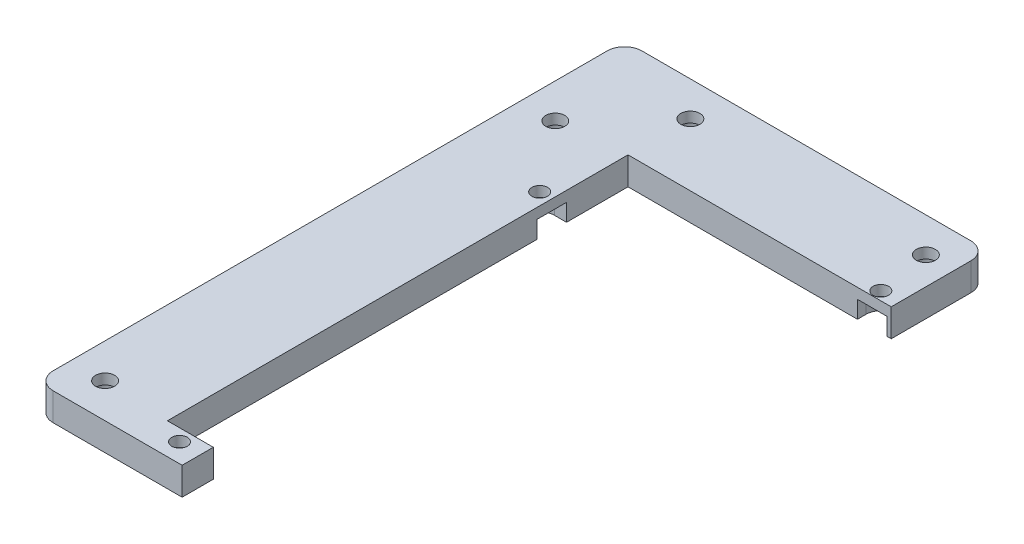
ISO-10303-21;
HEADER;
FILE_DESCRIPTION(('STEP AP214'),'2;1');
FILE_NAME('part.step','',(''),(''),'','','');
FILE_SCHEMA(('AUTOMOTIVE_DESIGN { 1 0 10303 214 1 1 1 1 }'));
ENDSEC;
DATA;
#1=APPLICATION_CONTEXT('core data for automotive mechanical design processes');
#2=APPLICATION_PROTOCOL_DEFINITION('international standard','automotive_design',2000,#1);
#3=PRODUCT_CONTEXT('',#1,'mechanical');
#4=PRODUCT('Part','Part','',(#3));
#5=PRODUCT_RELATED_PRODUCT_CATEGORY('part','',(#4));
#6=PRODUCT_DEFINITION_FORMATION('','',#4);
#7=PRODUCT_DEFINITION_CONTEXT('part definition',#1,'design');
#8=PRODUCT_DEFINITION('design','',#6,#7);
#9=PRODUCT_DEFINITION_SHAPE('','',#8);
#10=(LENGTH_UNIT() NAMED_UNIT(*) SI_UNIT(.MILLI.,.METRE.));
#11=(NAMED_UNIT(*) PLANE_ANGLE_UNIT() SI_UNIT($,.RADIAN.));
#12=(NAMED_UNIT(*) SI_UNIT($,.STERADIAN.) SOLID_ANGLE_UNIT());
#13=UNCERTAINTY_MEASURE_WITH_UNIT(LENGTH_MEASURE(1.E-05),#10,'distance_accuracy_value','');
#14=(GEOMETRIC_REPRESENTATION_CONTEXT(3) GLOBAL_UNCERTAINTY_ASSIGNED_CONTEXT((#13)) GLOBAL_UNIT_ASSIGNED_CONTEXT((#10,
#11,#12)) REPRESENTATION_CONTEXT('',''));
#15=CARTESIAN_POINT('',(0.,0.,0.));
#16=DIRECTION('',(0.,0.,1.));
#17=DIRECTION('',(1.,0.,0.));
#18=AXIS2_PLACEMENT_3D('',#15,#16,#17);
#19=CARTESIAN_POINT('',(-23.5,-4.,0.));
#20=DIRECTION('',(-1.,0.,0.));
#21=DIRECTION('',(0.,0.,1.));
#22=AXIS2_PLACEMENT_3D('',#19,#20,#21);
#23=PLANE('',#22);
#24=DIRECTION('',(0.,-1.,0.));
#25=VECTOR('',#24,1.);
#26=CARTESIAN_POINT('',(-23.5,1.,-30.75));
#27=LINE('',#26,#25);
#28=CARTESIAN_POINT('',(-23.5,1.,-30.75));
#29=VERTEX_POINT('',#28);
#30=CARTESIAN_POINT('',(-23.5,-4.,-30.75));
#31=VERTEX_POINT('',#30);
#32=EDGE_CURVE('E490',#29,#31,#27,.T.);
#33=ORIENTED_EDGE('',*,*,#32,.F.);
#34=DIRECTION('',(0.,0.,1.));
#35=VECTOR('',#34,1.);
#36=CARTESIAN_POINT('',(-23.5,1.,-39.25));
#37=LINE('',#36,#35);
#38=CARTESIAN_POINT('',(-23.5,1.,-39.25));
#39=VERTEX_POINT('',#38);
#40=EDGE_CURVE('E509',#39,#29,#37,.T.);
#41=ORIENTED_EDGE('',*,*,#40,.F.);
#42=DIRECTION('',(0.,-1.,0.));
#43=VECTOR('',#42,1.);
#44=CARTESIAN_POINT('',(-23.5,1.,-39.25));
#45=LINE('',#44,#43);
#46=CARTESIAN_POINT('',(-23.5,-4.,-39.25));
#47=VERTEX_POINT('',#46);
#48=EDGE_CURVE('E486',#39,#47,#45,.T.);
#49=ORIENTED_EDGE('',*,*,#48,.T.);
#50=DIRECTION('',(0.,0.,1.));
#51=VECTOR('',#50,1.);
#52=CARTESIAN_POINT('',(-23.5,-4.,0.));
#53=LINE('',#52,#51);
#54=CARTESIAN_POINT('',(-23.5,-4.,-57.));
#55=VERTEX_POINT('',#54);
#56=EDGE_CURVE('E238',#55,#47,#53,.T.);
#57=ORIENTED_EDGE('',*,*,#56,.F.);
#58=DIRECTION('',(0.,1.,0.));
#59=VECTOR('',#58,1.);
#60=CARTESIAN_POINT('',(-23.5,-4.,-57.));
#61=LINE('',#60,#59);
#62=CARTESIAN_POINT('',(-23.5,4.,-57.));
#63=VERTEX_POINT('',#62);
#64=EDGE_CURVE('E227',#55,#63,#61,.T.);
#65=ORIENTED_EDGE('',*,*,#64,.T.);
#66=DIRECTION('',(0.,0.,1.));
#67=VECTOR('',#66,1.);
#68=CARTESIAN_POINT('',(-23.5,4.,0.));
#69=LINE('',#68,#67);
#70=CARTESIAN_POINT('',(-23.5,4.,76.));
#71=VERTEX_POINT('',#70);
#72=EDGE_CURVE('E362',#63,#71,#69,.T.);
#73=ORIENTED_EDGE('',*,*,#72,.T.);
#74=DIRECTION('',(0.,1.,0.));
#75=VECTOR('',#74,1.);
#76=CARTESIAN_POINT('',(-23.5,-4.,76.));
#77=LINE('',#76,#75);
#78=CARTESIAN_POINT('',(-23.5,-4.,76.));
#79=VERTEX_POINT('',#78);
#80=EDGE_CURVE('E258',#79,#71,#77,.T.);
#81=ORIENTED_EDGE('',*,*,#80,.F.);
#82=EDGE_CURVE('E402',#31,#79,#53,.T.);
#83=ORIENTED_EDGE('',*,*,#82,.F.);
#84=EDGE_LOOP('',(#33,#41,#49,#57,#65,#73,#81,#83));
#85=FACE_BOUND('',#84,.T.);
#86=ADVANCED_FACE('F43',(#85),#23,.F.);
#87=CARTESIAN_POINT('',(0.,-4.,76.));
#88=DIRECTION('',(0.,0.,1.));
#89=DIRECTION('',(1.,0.,0.));
#90=AXIS2_PLACEMENT_3D('',#87,#88,#89);
#91=PLANE('',#90);
#92=DIRECTION('',(0.,-1.,0.));
#93=VECTOR('',#92,1.);
#94=CARTESIAN_POINT('',(-12.25,1.,76.));
#95=LINE('',#94,#93);
#96=CARTESIAN_POINT('',(-12.25,1.,76.));
#97=VERTEX_POINT('',#96);
#98=CARTESIAN_POINT('',(-12.25,-4.,76.));
#99=VERTEX_POINT('',#98);
#100=EDGE_CURVE('E527',#97,#99,#95,.T.);
#101=ORIENTED_EDGE('',*,*,#100,.F.);
#102=DIRECTION('',(-1.,0.,0.));
#103=VECTOR('',#102,1.);
#104=CARTESIAN_POINT('',(-12.25,1.,76.));
#105=LINE('',#104,#103);
#106=CARTESIAN_POINT('',(-20.75,1.,76.));
#107=VERTEX_POINT('',#106);
#108=EDGE_CURVE('E558',#97,#107,#105,.T.);
#109=ORIENTED_EDGE('',*,*,#108,.T.);
#110=DIRECTION('',(0.,-1.,0.));
#111=VECTOR('',#110,1.);
#112=CARTESIAN_POINT('',(-20.75,1.,76.));
#113=LINE('',#112,#111);
#114=CARTESIAN_POINT('',(-20.75,-4.,76.));
#115=VERTEX_POINT('',#114);
#116=EDGE_CURVE('E530',#107,#115,#113,.T.);
#117=ORIENTED_EDGE('',*,*,#116,.T.);
#118=DIRECTION('',(1.,0.,0.));
#119=VECTOR('',#118,1.);
#120=CARTESIAN_POINT('',(0.,-4.,76.));
#121=LINE('',#120,#119);
#122=EDGE_CURVE('E399',#79,#115,#121,.T.);
#123=ORIENTED_EDGE('',*,*,#122,.F.);
#124=ORIENTED_EDGE('',*,*,#80,.T.);
#125=DIRECTION('',(1.,0.,0.));
#126=VECTOR('',#125,1.);
#127=CARTESIAN_POINT('',(0.,4.,76.));
#128=LINE('',#127,#126);
#129=CARTESIAN_POINT('',(-10.25,4.,76.));
#130=VERTEX_POINT('',#129);
#131=EDGE_CURVE('E358',#71,#130,#128,.T.);
#132=ORIENTED_EDGE('',*,*,#131,.T.);
#133=DIRECTION('',(0.,1.,0.));
#134=VECTOR('',#133,1.);
#135=CARTESIAN_POINT('',(-10.25,-4.,76.));
#136=LINE('',#135,#134);
#137=CARTESIAN_POINT('',(-10.25,-4.,76.));
#138=VERTEX_POINT('',#137);
#139=EDGE_CURVE('E261',#138,#130,#136,.T.);
#140=ORIENTED_EDGE('',*,*,#139,.F.);
#141=EDGE_CURVE('E398',#99,#138,#121,.T.);
#142=ORIENTED_EDGE('',*,*,#141,.F.);
#143=EDGE_LOOP('',(#101,#109,#117,#123,#124,#132,#140,#142));
#144=FACE_BOUND('',#143,.T.);
#145=ADVANCED_FACE('F415',(#144),#91,.F.);
#146=CARTESIAN_POINT('',(-42.5,-4.,75.));
#147=DIRECTION('',(0.,1.,0.));
#148=DIRECTION('',(0.,0.,1.));
#149=AXIS2_PLACEMENT_3D('',#146,#147,#148);
#150=CYLINDRICAL_SURFACE('',#149,2.75);
#151=CARTESIAN_POINT('',(-42.5,4.,75.));
#152=DIRECTION('',(0.,1.,0.));
#153=DIRECTION('',(0.,0.,1.));
#154=AXIS2_PLACEMENT_3D('',#151,#152,#153);
#155=CIRCLE('',#154,2.75);
#156=CARTESIAN_POINT('',(-42.5,4.,77.75));
#157=VERTEX_POINT('',#156);
#158=EDGE_CURVE('E334',#157,#157,#155,.T.);
#159=ORIENTED_EDGE('',*,*,#158,.T.);
#160=EDGE_LOOP('',(#159));
#161=FACE_BOUND('',#160,.T.);
#162=CARTESIAN_POINT('',(-42.5,1.,75.));
#163=DIRECTION('',(0.,-1.,0.));
#164=DIRECTION('',(0.,0.,-1.));
#165=AXIS2_PLACEMENT_3D('',#162,#163,#164);
#166=CIRCLE('',#165,2.75);
#167=CARTESIAN_POINT('',(-42.5,1.,72.25));
#168=VERTEX_POINT('',#167);
#169=EDGE_CURVE('E47',#168,#168,#166,.F.);
#170=ORIENTED_EDGE('',*,*,#169,.F.);
#171=EDGE_LOOP('',(#170));
#172=FACE_BOUND('',#171,.T.);
#173=ADVANCED_FACE('F612',(#161,#172),#150,.F.);
#174=CARTESIAN_POINT('',(-16.5,-4.,79.5));
#175=DIRECTION('',(0.,1.,0.));
#176=DIRECTION('',(0.,0.,1.));
#177=AXIS2_PLACEMENT_3D('',#174,#175,#176);
#178=CYLINDRICAL_SURFACE('',#177,2.25);
#179=CARTESIAN_POINT('',(-16.5,4.,79.5));
#180=DIRECTION('',(0.,1.,0.));
#181=DIRECTION('',(0.,0.,1.));
#182=AXIS2_PLACEMENT_3D('',#179,#180,#181);
#183=CIRCLE('',#182,2.25);
#184=CARTESIAN_POINT('',(-16.5,4.,81.75));
#185=VERTEX_POINT('',#184);
#186=EDGE_CURVE('E330',#185,#185,#183,.T.);
#187=ORIENTED_EDGE('',*,*,#186,.T.);
#188=EDGE_LOOP('',(#187));
#189=FACE_BOUND('',#188,.T.);
#190=CARTESIAN_POINT('',(-16.5,1.,79.5));
#191=DIRECTION('',(0.,-1.,0.));
#192=DIRECTION('',(0.,0.,-1.));
#193=AXIS2_PLACEMENT_3D('',#190,#191,#192);
#194=CIRCLE('',#193,2.25);
#195=CARTESIAN_POINT('',(-16.5,1.,77.25));
#196=VERTEX_POINT('',#195);
#197=EDGE_CURVE('E295',#196,#196,#194,.F.);
#198=ORIENTED_EDGE('',*,*,#197,.F.);
#199=EDGE_LOOP('',(#198));
#200=FACE_BOUND('',#199,.T.);
#201=ADVANCED_FACE('F631',(#189,#200),#178,.F.);
#202=CARTESIAN_POINT('',(-27.,-4.,-35.));
#203=DIRECTION('',(0.,1.,0.));
#204=DIRECTION('',(0.,0.,1.));
#205=AXIS2_PLACEMENT_3D('',#202,#203,#204);
#206=CYLINDRICAL_SURFACE('',#205,2.25);
#207=CARTESIAN_POINT('',(-27.,4.,-35.));
#208=DIRECTION('',(0.,1.,0.));
#209=DIRECTION('',(0.,0.,1.));
#210=AXIS2_PLACEMENT_3D('',#207,#208,#209);
#211=CIRCLE('',#210,2.25);
#212=CARTESIAN_POINT('',(-27.,4.,-32.75));
#213=VERTEX_POINT('',#212);
#214=EDGE_CURVE('E326',#213,#213,#211,.T.);
#215=ORIENTED_EDGE('',*,*,#214,.T.);
#216=EDGE_LOOP('',(#215));
#217=FACE_BOUND('',#216,.T.);
#218=CARTESIAN_POINT('',(-27.,1.,-35.));
#219=DIRECTION('',(0.,-1.,0.));
#220=DIRECTION('',(0.,0.,-1.));
#221=AXIS2_PLACEMENT_3D('',#218,#219,#220);
#222=CIRCLE('',#221,2.25);
#223=CARTESIAN_POINT('',(-27.,1.,-37.25));
#224=VERTEX_POINT('',#223);
#225=EDGE_CURVE('E292',#224,#224,#222,.F.);
#226=ORIENTED_EDGE('',*,*,#225,.F.);
#227=EDGE_LOOP('',(#226));
#228=FACE_BOUND('',#227,.T.);
#229=ADVANCED_FACE('F635',(#217,#228),#206,.F.);
#230=CARTESIAN_POINT('',(47.,-4.,-59.5));
#231=DIRECTION('',(0.,1.,0.));
#232=DIRECTION('',(0.,0.,1.));
#233=AXIS2_PLACEMENT_3D('',#230,#231,#232);
#234=CYLINDRICAL_SURFACE('',#233,2.25);
#235=CARTESIAN_POINT('',(47.,4.,-59.5));
#236=DIRECTION('',(0.,1.,0.));
#237=DIRECTION('',(0.,0.,1.));
#238=AXIS2_PLACEMENT_3D('',#235,#236,#237);
#239=CIRCLE('',#238,2.25);
#240=CARTESIAN_POINT('',(47.,4.,-57.25));
#241=VERTEX_POINT('',#240);
#242=EDGE_CURVE('E322',#241,#241,#239,.T.);
#243=ORIENTED_EDGE('',*,*,#242,.T.);
#244=EDGE_LOOP('',(#243));
#245=FACE_BOUND('',#244,.T.);
#246=CARTESIAN_POINT('',(47.,1.,-59.5));
#247=DIRECTION('',(0.,-1.,0.));
#248=DIRECTION('',(0.,0.,-1.));
#249=AXIS2_PLACEMENT_3D('',#246,#247,#248);
#250=CIRCLE('',#249,2.25);
#251=CARTESIAN_POINT('',(47.,1.,-61.75));
#252=VERTEX_POINT('',#251);
#253=EDGE_CURVE('E288',#252,#252,#250,.F.);
#254=ORIENTED_EDGE('',*,*,#253,.F.);
#255=EDGE_LOOP('',(#254));
#256=FACE_BOUND('',#255,.T.);
#257=ADVANCED_FACE('F639',(#245,#256),#234,.F.);
#258=CARTESIAN_POINT('',(-23.5,-4.,-75.));
#259=DIRECTION('',(0.,1.,0.));
#260=DIRECTION('',(0.,0.,1.));
#261=AXIS2_PLACEMENT_3D('',#258,#259,#260);
#262=CYLINDRICAL_SURFACE('',#261,2.75);
#263=CARTESIAN_POINT('',(-23.5,4.,-75.));
#264=DIRECTION('',(0.,1.,0.));
#265=DIRECTION('',(0.,0.,1.));
#266=AXIS2_PLACEMENT_3D('',#263,#264,#265);
#267=CIRCLE('',#266,2.75);
#268=CARTESIAN_POINT('',(-23.5,4.,-72.25));
#269=VERTEX_POINT('',#268);
#270=EDGE_CURVE('E313',#269,#269,#267,.T.);
#271=ORIENTED_EDGE('',*,*,#270,.T.);
#272=EDGE_LOOP('',(#271));
#273=FACE_BOUND('',#272,.T.);
#274=CARTESIAN_POINT('',(-23.5,1.,-75.));
#275=DIRECTION('',(0.,-1.,0.));
#276=DIRECTION('',(0.,0.,-1.));
#277=AXIS2_PLACEMENT_3D('',#274,#275,#276);
#278=CIRCLE('',#277,2.75);
#279=CARTESIAN_POINT('',(-23.5,1.,-77.75));
#280=VERTEX_POINT('',#279);
#281=EDGE_CURVE('E284',#280,#280,#278,.F.);
#282=ORIENTED_EDGE('',*,*,#281,.F.);
#283=EDGE_LOOP('',(#282));
#284=FACE_BOUND('',#283,.T.);
#285=ADVANCED_FACE('F643',(#273,#284),#262,.F.);
#286=CARTESIAN_POINT('',(-42.5,-4.,-55.));
#287=DIRECTION('',(0.,1.,0.));
#288=DIRECTION('',(0.,0.,1.));
#289=AXIS2_PLACEMENT_3D('',#286,#287,#288);
#290=CYLINDRICAL_SURFACE('',#289,2.74999999999998);
#291=CARTESIAN_POINT('',(-42.5,4.,-55.));
#292=DIRECTION('',(0.,1.,0.));
#293=DIRECTION('',(0.,0.,1.));
#294=AXIS2_PLACEMENT_3D('',#291,#292,#293);
#295=CIRCLE('',#294,2.74999999999998);
#296=CARTESIAN_POINT('',(-42.5,4.,-52.25));
#297=VERTEX_POINT('',#296);
#298=EDGE_CURVE('E307',#297,#297,#295,.T.);
#299=ORIENTED_EDGE('',*,*,#298,.T.);
#300=EDGE_LOOP('',(#299));
#301=FACE_BOUND('',#300,.T.);
#302=CARTESIAN_POINT('',(-42.5,1.,-55.));
#303=DIRECTION('',(0.,-1.,0.));
#304=DIRECTION('',(0.,0.,-1.));
#305=AXIS2_PLACEMENT_3D('',#302,#303,#304);
#306=CIRCLE('',#305,2.74999999999998);
#307=CARTESIAN_POINT('',(-42.5,1.,-57.75));
#308=VERTEX_POINT('',#307);
#309=EDGE_CURVE('E279',#308,#308,#306,.F.);
#310=ORIENTED_EDGE('',*,*,#309,.F.);
#311=EDGE_LOOP('',(#310));
#312=FACE_BOUND('',#311,.T.);
#313=ADVANCED_FACE('F646',(#301,#312),#290,.F.);
#314=CARTESIAN_POINT('',(44.5,-4.,-75.));
#315=DIRECTION('',(0.,1.,0.));
#316=DIRECTION('',(0.,0.,1.));
#317=AXIS2_PLACEMENT_3D('',#314,#315,#316);
#318=CYLINDRICAL_SURFACE('',#317,2.75);
#319=CARTESIAN_POINT('',(44.5,4.,-75.));
#320=DIRECTION('',(0.,1.,0.));
#321=DIRECTION('',(0.,0.,1.));
#322=AXIS2_PLACEMENT_3D('',#319,#320,#321);
#323=CIRCLE('',#322,2.75);
#324=CARTESIAN_POINT('',(44.5,4.,-72.25));
#325=VERTEX_POINT('',#324);
#326=EDGE_CURVE('E302',#325,#325,#323,.T.);
#327=ORIENTED_EDGE('',*,*,#326,.T.);
#328=EDGE_LOOP('',(#327));
#329=FACE_BOUND('',#328,.T.);
#330=CARTESIAN_POINT('',(44.5,1.,-75.));
#331=DIRECTION('',(0.,-1.,0.));
#332=DIRECTION('',(0.,0.,-1.));
#333=AXIS2_PLACEMENT_3D('',#330,#331,#332);
#334=CIRCLE('',#333,2.75);
#335=CARTESIAN_POINT('',(44.5,1.,-77.75));
#336=VERTEX_POINT('',#335);
#337=EDGE_CURVE('E275',#336,#336,#334,.F.);
#338=ORIENTED_EDGE('',*,*,#337,.F.);
#339=EDGE_LOOP('',(#338));
#340=FACE_BOUND('',#339,.T.);
#341=ADVANCED_FACE('F45',(#329,#340),#318,.F.);
#342=CARTESIAN_POINT('',(0.,-4.,0.));
#343=DIRECTION('',(0.,1.,0.));
#344=DIRECTION('',(0.,0.,1.));
#345=AXIS2_PLACEMENT_3D('',#342,#343,#344);
#346=PLANE('',#345);
#347=CARTESIAN_POINT('',(-42.5,-4.,75.));
#348=DIRECTION('',(0.,-1.,0.));
#349=DIRECTION('',(0.,0.,-1.));
#350=AXIS2_PLACEMENT_3D('',#347,#348,#349);
#351=CIRCLE('',#350,4.25);
#352=CARTESIAN_POINT('',(-42.5,-4.,70.75));
#353=VERTEX_POINT('',#352);
#354=EDGE_CURVE('E531',#353,#353,#351,.T.);
#355=ORIENTED_EDGE('',*,*,#354,.F.);
#356=EDGE_LOOP('',(#355));
#357=FACE_BOUND('',#356,.T.);
#358=CARTESIAN_POINT('',(44.5,-4.,-75.));
#359=DIRECTION('',(0.,-1.,0.));
#360=DIRECTION('',(0.,0.,-1.));
#361=AXIS2_PLACEMENT_3D('',#358,#359,#360);
#362=CIRCLE('',#361,4.25);
#363=CARTESIAN_POINT('',(44.5,-4.,-79.25));
#364=VERTEX_POINT('',#363);
#365=EDGE_CURVE('E577',#364,#364,#362,.T.);
#366=ORIENTED_EDGE('',*,*,#365,.F.);
#367=EDGE_LOOP('',(#366));
#368=FACE_BOUND('',#367,.T.);
#369=CARTESIAN_POINT('',(-23.5,-4.,-75.));
#370=DIRECTION('',(0.,-1.,0.));
#371=DIRECTION('',(0.,0.,-1.));
#372=AXIS2_PLACEMENT_3D('',#369,#370,#371);
#373=CIRCLE('',#372,4.25);
#374=CARTESIAN_POINT('',(-23.5,-4.,-79.25));
#375=VERTEX_POINT('',#374);
#376=EDGE_CURVE('E316',#375,#375,#373,.T.);
#377=ORIENTED_EDGE('',*,*,#376,.F.);
#378=EDGE_LOOP('',(#377));
#379=FACE_BOUND('',#378,.T.);
#380=CARTESIAN_POINT('',(-42.5,-4.,-55.));
#381=DIRECTION('',(0.,-1.,0.));
#382=DIRECTION('',(0.,0.,-1.));
#383=AXIS2_PLACEMENT_3D('',#380,#381,#382);
#384=CIRCLE('',#383,4.25);
#385=CARTESIAN_POINT('',(-42.5,-4.,-59.25));
#386=VERTEX_POINT('',#385);
#387=EDGE_CURVE('E496',#386,#386,#384,.T.);
#388=ORIENTED_EDGE('',*,*,#387,.F.);
#389=EDGE_LOOP('',(#388));
#390=FACE_BOUND('',#389,.T.);
#391=DIRECTION('',(0.,0.,-1.));
#392=VECTOR('',#391,1.);
#393=CARTESIAN_POINT('',(-12.25,-4.,79.5));
#394=LINE('',#393,#392);
#395=CARTESIAN_POINT('',(-12.25,-4.,79.5));
#396=VERTEX_POINT('',#395);
#397=EDGE_CURVE('E61',#396,#99,#394,.T.);
#398=ORIENTED_EDGE('',*,*,#397,.T.);
#399=ORIENTED_EDGE('',*,*,#141,.T.);
#400=DIRECTION('',(0.,0.,1.));
#401=VECTOR('',#400,1.);
#402=CARTESIAN_POINT('',(-10.25,-4.,0.));
#403=LINE('',#402,#401);
#404=CARTESIAN_POINT('',(-10.25,-4.,85.));
#405=VERTEX_POINT('',#404);
#406=EDGE_CURVE('E396',#138,#405,#403,.T.);
#407=ORIENTED_EDGE('',*,*,#406,.T.);
#408=DIRECTION('',(1.,0.,0.));
#409=VECTOR('',#408,1.);
#410=CARTESIAN_POINT('',(0.,-4.,85.));
#411=LINE('',#410,#409);
#412=CARTESIAN_POINT('',(-47.4999999999999,-4.,85.));
#413=VERTEX_POINT('',#412);
#414=EDGE_CURVE('E392',#413,#405,#411,.T.);
#415=ORIENTED_EDGE('',*,*,#414,.F.);
#416=CARTESIAN_POINT('',(-47.5,-4.,80.));
#417=DIRECTION('',(0.,1.,0.));
#418=DIRECTION('',(0.,0.,1.));
#419=AXIS2_PLACEMENT_3D('',#416,#417,#418);
#420=CIRCLE('',#419,5.);
#421=CARTESIAN_POINT('',(-52.5,-4.,80.));
#422=VERTEX_POINT('',#421);
#423=EDGE_CURVE('E389',#413,#422,#420,.F.);
#424=ORIENTED_EDGE('',*,*,#423,.T.);
#425=DIRECTION('',(0.,0.,-1.));
#426=VECTOR('',#425,1.);
#427=CARTESIAN_POINT('',(-52.5,-4.,0.));
#428=LINE('',#427,#426);
#429=CARTESIAN_POINT('',(-52.5,-4.,-80.));
#430=VERTEX_POINT('',#429);
#431=EDGE_CURVE('E386',#422,#430,#428,.T.);
#432=ORIENTED_EDGE('',*,*,#431,.T.);
#433=CARTESIAN_POINT('',(-47.5,-4.,-80.));
#434=DIRECTION('',(0.,1.,0.));
#435=DIRECTION('',(0.,0.,1.));
#436=AXIS2_PLACEMENT_3D('',#433,#434,#435);
#437=CIRCLE('',#436,5.);
#438=CARTESIAN_POINT('',(-47.4999999999999,-4.,-85.));
#439=VERTEX_POINT('',#438);
#440=EDGE_CURVE('E382',#430,#439,#437,.F.);
#441=ORIENTED_EDGE('',*,*,#440,.T.);
#442=DIRECTION('',(1.,0.,0.));
#443=VECTOR('',#442,1.);
#444=CARTESIAN_POINT('',(0.,-4.,-85.));
#445=LINE('',#444,#443);
#446=CARTESIAN_POINT('',(47.5,-4.,-85.));
#447=VERTEX_POINT('',#446);
#448=EDGE_CURVE('E244',#439,#447,#445,.T.);
#449=ORIENTED_EDGE('',*,*,#448,.T.);
#450=CARTESIAN_POINT('',(47.5,-4.,-80.));
#451=DIRECTION('',(0.,1.,0.));
#452=DIRECTION('',(0.,0.,1.));
#453=AXIS2_PLACEMENT_3D('',#450,#451,#452);
#454=CIRCLE('',#453,5.);
#455=CARTESIAN_POINT('',(52.5,-4.,-80.));
#456=VERTEX_POINT('',#455);
#457=EDGE_CURVE('E236',#447,#456,#454,.F.);
#458=ORIENTED_EDGE('',*,*,#457,.T.);
#459=DIRECTION('',(0.,0.,-1.));
#460=VECTOR('',#459,1.);
#461=CARTESIAN_POINT('',(52.5,-4.,0.));
#462=LINE('',#461,#460);
#463=CARTESIAN_POINT('',(52.5,-4.,-57.));
#464=VERTEX_POINT('',#463);
#465=EDGE_CURVE('E230',#464,#456,#462,.T.);
#466=ORIENTED_EDGE('',*,*,#465,.F.);
#467=DIRECTION('',(1.,0.,0.));
#468=VECTOR('',#467,1.);
#469=CARTESIAN_POINT('',(0.,-4.,-57.));
#470=LINE('',#469,#468);
#471=CARTESIAN_POINT('',(51.25,-4.,-57.));
#472=VERTEX_POINT('',#471);
#473=EDGE_CURVE('E231',#472,#464,#470,.T.);
#474=ORIENTED_EDGE('',*,*,#473,.F.);
#475=DIRECTION('',(0.,0.,1.));
#476=VECTOR('',#475,1.);
#477=CARTESIAN_POINT('',(51.25,-4.,-59.5));
#478=LINE('',#477,#476);
#479=CARTESIAN_POINT('',(51.25,-4.,-59.5));
#480=VERTEX_POINT('',#479);
#481=EDGE_CURVE('E453',#480,#472,#478,.T.);
#482=ORIENTED_EDGE('',*,*,#481,.F.);
#483=CARTESIAN_POINT('',(47.,-4.,-59.5));
#484=DIRECTION('',(0.,-1.,0.));
#485=DIRECTION('',(0.,0.,-1.));
#486=AXIS2_PLACEMENT_3D('',#483,#484,#485);
#487=CIRCLE('',#486,4.25);
#488=CARTESIAN_POINT('',(42.75,-4.,-59.5));
#489=VERTEX_POINT('',#488);
#490=EDGE_CURVE('E221',#489,#480,#487,.T.);
#491=ORIENTED_EDGE('',*,*,#490,.F.);
#492=DIRECTION('',(0.,0.,-1.));
#493=VECTOR('',#492,1.);
#494=CARTESIAN_POINT('',(42.75,-4.,-57.));
#495=LINE('',#494,#493);
#496=CARTESIAN_POINT('',(42.75,-4.,-57.));
#497=VERTEX_POINT('',#496);
#498=EDGE_CURVE('E202',#497,#489,#495,.T.);
#499=ORIENTED_EDGE('',*,*,#498,.F.);
#500=EDGE_CURVE('E218',#55,#497,#470,.T.);
#501=ORIENTED_EDGE('',*,*,#500,.F.);
#502=ORIENTED_EDGE('',*,*,#56,.T.);
#503=DIRECTION('',(1.,0.,0.));
#504=VECTOR('',#503,1.);
#505=CARTESIAN_POINT('',(-27.,-4.,-39.25));
#506=LINE('',#505,#504);
#507=CARTESIAN_POINT('',(-27.,-4.,-39.25));
#508=VERTEX_POINT('',#507);
#509=EDGE_CURVE('E501',#508,#47,#506,.T.);
#510=ORIENTED_EDGE('',*,*,#509,.F.);
#511=CARTESIAN_POINT('',(-27.,-4.,-35.));
#512=DIRECTION('',(0.,-1.,0.));
#513=DIRECTION('',(0.,0.,-1.));
#514=AXIS2_PLACEMENT_3D('',#511,#512,#513);
#515=CIRCLE('',#514,4.25);
#516=CARTESIAN_POINT('',(-27.,-4.,-30.75));
#517=VERTEX_POINT('',#516);
#518=EDGE_CURVE('E69',#517,#508,#515,.T.);
#519=ORIENTED_EDGE('',*,*,#518,.F.);
#520=DIRECTION('',(1.,0.,0.));
#521=VECTOR('',#520,1.);
#522=CARTESIAN_POINT('',(-27.,-4.,-30.75));
#523=LINE('',#522,#521);
#524=EDGE_CURVE('E497',#517,#31,#523,.T.);
#525=ORIENTED_EDGE('',*,*,#524,.T.);
#526=ORIENTED_EDGE('',*,*,#82,.T.);
#527=ORIENTED_EDGE('',*,*,#122,.T.);
#528=DIRECTION('',(0.,0.,1.));
#529=VECTOR('',#528,1.);
#530=CARTESIAN_POINT('',(-20.75,-4.,76.));
#531=LINE('',#530,#529);
#532=CARTESIAN_POINT('',(-20.75,-4.,79.5));
#533=VERTEX_POINT('',#532);
#534=EDGE_CURVE('E546',#115,#533,#531,.T.);
#535=ORIENTED_EDGE('',*,*,#534,.T.);
#536=CARTESIAN_POINT('',(-16.5,-4.,79.5));
#537=DIRECTION('',(0.,-1.,0.));
#538=DIRECTION('',(0.,0.,-1.));
#539=AXIS2_PLACEMENT_3D('',#536,#537,#538);
#540=CIRCLE('',#539,4.25);
#541=EDGE_CURVE('E542',#396,#533,#540,.T.);
#542=ORIENTED_EDGE('',*,*,#541,.F.);
#543=EDGE_LOOP('',(#398,#399,#407,#415,#424,#432,#441,#449,#458,#466,#474,#482,#491,#499,#501,
#502,#510,#519,#525,#526,#527,#535,#542));
#544=FACE_BOUND('',#543,.T.);
#545=ADVANCED_FACE('F216',(#357,#368,#379,#390,#544),#346,.F.);
#546=CARTESIAN_POINT('',(-47.5,-4.,-80.));
#547=DIRECTION('',(0.,1.,0.));
#548=DIRECTION('',(0.,0.,1.));
#549=AXIS2_PLACEMENT_3D('',#546,#547,#548);
#550=CYLINDRICAL_SURFACE('',#549,5.);
#551=DIRECTION('',(0.,1.,0.));
#552=VECTOR('',#551,1.);
#553=CARTESIAN_POINT('',(-52.5,-4.,-80.));
#554=LINE('',#553,#552);
#555=CARTESIAN_POINT('',(-52.5,4.,-80.));
#556=VERTEX_POINT('',#555);
#557=EDGE_CURVE('E246',#430,#556,#554,.T.);
#558=ORIENTED_EDGE('',*,*,#557,.T.);
#559=CARTESIAN_POINT('',(-47.5,4.,-80.));
#560=DIRECTION('',(0.,1.,0.));
#561=DIRECTION('',(0.,0.,1.));
#562=AXIS2_PLACEMENT_3D('',#559,#560,#561);
#563=CIRCLE('',#562,5.);
#564=CARTESIAN_POINT('',(-47.4999999999999,4.,-85.));
#565=VERTEX_POINT('',#564);
#566=EDGE_CURVE('E338',#556,#565,#563,.F.);
#567=ORIENTED_EDGE('',*,*,#566,.T.);
#568=DIRECTION('',(0.,1.,0.));
#569=VECTOR('',#568,1.);
#570=CARTESIAN_POINT('',(-47.4999999999999,-4.,-85.));
#571=LINE('',#570,#569);
#572=EDGE_CURVE('E11',#439,#565,#571,.T.);
#573=ORIENTED_EDGE('',*,*,#572,.F.);
#574=ORIENTED_EDGE('',*,*,#440,.F.);
#575=EDGE_LOOP('',(#558,#567,#573,#574));
#576=FACE_BOUND('',#575,.T.);
#577=ADVANCED_FACE('F437',(#576),#550,.T.);
#578=CARTESIAN_POINT('',(0.,-4.,-85.));
#579=DIRECTION('',(0.,0.,1.));
#580=DIRECTION('',(1.,0.,0.));
#581=AXIS2_PLACEMENT_3D('',#578,#579,#580);
#582=PLANE('',#581);
#583=ORIENTED_EDGE('',*,*,#572,.T.);
#584=DIRECTION('',(1.,0.,0.));
#585=VECTOR('',#584,1.);
#586=CARTESIAN_POINT('',(0.,4.,-85.));
#587=LINE('',#586,#585);
#588=CARTESIAN_POINT('',(47.5,4.,-85.));
#589=VERTEX_POINT('',#588);
#590=EDGE_CURVE('E378',#565,#589,#587,.T.);
#591=ORIENTED_EDGE('',*,*,#590,.T.);
#592=DIRECTION('',(0.,1.,0.));
#593=VECTOR('',#592,1.);
#594=CARTESIAN_POINT('',(47.5,-4.,-85.));
#595=LINE('',#594,#593);
#596=EDGE_CURVE('E53',#447,#589,#595,.T.);
#597=ORIENTED_EDGE('',*,*,#596,.F.);
#598=ORIENTED_EDGE('',*,*,#448,.F.);
#599=EDGE_LOOP('',(#583,#591,#597,#598));
#600=FACE_BOUND('',#599,.T.);
#601=ADVANCED_FACE('F443',(#600),#582,.F.);
#602=CARTESIAN_POINT('',(47.5,-4.,-80.));
#603=DIRECTION('',(0.,1.,0.));
#604=DIRECTION('',(0.,0.,1.));
#605=AXIS2_PLACEMENT_3D('',#602,#603,#604);
#606=CYLINDRICAL_SURFACE('',#605,5.);
#607=ORIENTED_EDGE('',*,*,#596,.T.);
#608=CARTESIAN_POINT('',(47.5,4.,-80.));
#609=DIRECTION('',(0.,1.,0.));
#610=DIRECTION('',(0.,0.,1.));
#611=AXIS2_PLACEMENT_3D('',#608,#609,#610);
#612=CIRCLE('',#611,5.);
#613=CARTESIAN_POINT('',(52.5,4.,-80.));
#614=VERTEX_POINT('',#613);
#615=EDGE_CURVE('E374',#589,#614,#612,.F.);
#616=ORIENTED_EDGE('',*,*,#615,.T.);
#617=DIRECTION('',(0.,1.,0.));
#618=VECTOR('',#617,1.);
#619=CARTESIAN_POINT('',(52.5,-4.,-80.));
#620=LINE('',#619,#618);
#621=EDGE_CURVE('E250',#456,#614,#620,.T.);
#622=ORIENTED_EDGE('',*,*,#621,.F.);
#623=ORIENTED_EDGE('',*,*,#457,.F.);
#624=EDGE_LOOP('',(#607,#616,#622,#623));
#625=FACE_BOUND('',#624,.T.);
#626=ADVANCED_FACE('F447',(#625),#606,.T.);
#627=CARTESIAN_POINT('',(52.5,-4.,0.));
#628=DIRECTION('',(1.,0.,0.));
#629=DIRECTION('',(0.,0.,-1.));
#630=AXIS2_PLACEMENT_3D('',#627,#628,#629);
#631=PLANE('',#630);
#632=ORIENTED_EDGE('',*,*,#621,.T.);
#633=DIRECTION('',(0.,0.,-1.));
#634=VECTOR('',#633,1.);
#635=CARTESIAN_POINT('',(52.5,4.,0.));
#636=LINE('',#635,#634);
#637=CARTESIAN_POINT('',(52.5,4.,-57.));
#638=VERTEX_POINT('',#637);
#639=EDGE_CURVE('E370',#638,#614,#636,.T.);
#640=ORIENTED_EDGE('',*,*,#639,.F.);
#641=DIRECTION('',(0.,1.,0.));
#642=VECTOR('',#641,1.);
#643=CARTESIAN_POINT('',(52.5,-4.,-57.));
#644=LINE('',#643,#642);
#645=EDGE_CURVE('E253',#464,#638,#644,.T.);
#646=ORIENTED_EDGE('',*,*,#645,.F.);
#647=ORIENTED_EDGE('',*,*,#465,.T.);
#648=EDGE_LOOP('',(#632,#640,#646,#647));
#649=FACE_BOUND('',#648,.T.);
#650=ADVANCED_FACE('F451',(#649),#631,.T.);
#651=CARTESIAN_POINT('',(0.,-4.,-57.));
#652=DIRECTION('',(0.,0.,1.));
#653=DIRECTION('',(1.,0.,0.));
#654=AXIS2_PLACEMENT_3D('',#651,#652,#653);
#655=PLANE('',#654);
#656=DIRECTION('',(0.,-1.,0.));
#657=VECTOR('',#656,1.);
#658=CARTESIAN_POINT('',(42.75,1.,-57.));
#659=LINE('',#658,#657);
#660=CARTESIAN_POINT('',(42.75,1.,-57.));
#661=VERTEX_POINT('',#660);
#662=EDGE_CURVE('E199',#661,#497,#659,.T.);
#663=ORIENTED_EDGE('',*,*,#662,.F.);
#664=DIRECTION('',(-1.,0.,0.));
#665=VECTOR('',#664,1.);
#666=CARTESIAN_POINT('',(51.25,1.,-57.));
#667=LINE('',#666,#665);
#668=CARTESIAN_POINT('',(51.25,1.,-57.));
#669=VERTEX_POINT('',#668);
#670=EDGE_CURVE('E455',#669,#661,#667,.T.);
#671=ORIENTED_EDGE('',*,*,#670,.F.);
#672=DIRECTION('',(0.,-1.,0.));
#673=VECTOR('',#672,1.);
#674=CARTESIAN_POINT('',(51.25,1.,-57.));
#675=LINE('',#674,#673);
#676=EDGE_CURVE('E211',#669,#472,#675,.T.);
#677=ORIENTED_EDGE('',*,*,#676,.T.);
#678=ORIENTED_EDGE('',*,*,#473,.T.);
#679=ORIENTED_EDGE('',*,*,#645,.T.);
#680=DIRECTION('',(1.,0.,0.));
#681=VECTOR('',#680,1.);
#682=CARTESIAN_POINT('',(0.,4.,-57.));
#683=LINE('',#682,#681);
#684=EDGE_CURVE('E366',#63,#638,#683,.T.);
#685=ORIENTED_EDGE('',*,*,#684,.F.);
#686=ORIENTED_EDGE('',*,*,#64,.F.);
#687=ORIENTED_EDGE('',*,*,#500,.T.);
#688=EDGE_LOOP('',(#663,#671,#677,#678,#679,#685,#686,#687));
#689=FACE_BOUND('',#688,.T.);
#690=ADVANCED_FACE('F225',(#689),#655,.T.);
#691=CARTESIAN_POINT('',(-10.25,-4.,0.));
#692=DIRECTION('',(-1.,0.,0.));
#693=DIRECTION('',(0.,0.,1.));
#694=AXIS2_PLACEMENT_3D('',#691,#692,#693);
#695=PLANE('',#694);
#696=ORIENTED_EDGE('',*,*,#139,.T.);
#697=DIRECTION('',(0.,0.,1.));
#698=VECTOR('',#697,1.);
#699=CARTESIAN_POINT('',(-10.25,4.,0.));
#700=LINE('',#699,#698);
#701=CARTESIAN_POINT('',(-10.25,4.,85.));
#702=VERTEX_POINT('',#701);
#703=EDGE_CURVE('E354',#130,#702,#700,.T.);
#704=ORIENTED_EDGE('',*,*,#703,.T.);
#705=DIRECTION('',(0.,1.,0.));
#706=VECTOR('',#705,1.);
#707=CARTESIAN_POINT('',(-10.25,-4.,85.));
#708=LINE('',#707,#706);
#709=EDGE_CURVE('E264',#405,#702,#708,.T.);
#710=ORIENTED_EDGE('',*,*,#709,.F.);
#711=ORIENTED_EDGE('',*,*,#406,.F.);
#712=EDGE_LOOP('',(#696,#704,#710,#711));
#713=FACE_BOUND('',#712,.T.);
#714=ADVANCED_FACE('F419',(#713),#695,.F.);
#715=CARTESIAN_POINT('',(0.,-4.,85.));
#716=DIRECTION('',(0.,0.,1.));
#717=DIRECTION('',(1.,0.,0.));
#718=AXIS2_PLACEMENT_3D('',#715,#716,#717);
#719=PLANE('',#718);
#720=ORIENTED_EDGE('',*,*,#709,.T.);
#721=DIRECTION('',(1.,0.,0.));
#722=VECTOR('',#721,1.);
#723=CARTESIAN_POINT('',(0.,4.,85.));
#724=LINE('',#723,#722);
#725=CARTESIAN_POINT('',(-47.4999999999999,4.,85.));
#726=VERTEX_POINT('',#725);
#727=EDGE_CURVE('E350',#726,#702,#724,.T.);
#728=ORIENTED_EDGE('',*,*,#727,.F.);
#729=DIRECTION('',(0.,1.,0.));
#730=VECTOR('',#729,1.);
#731=CARTESIAN_POINT('',(-47.4999999999999,-4.,85.));
#732=LINE('',#731,#730);
#733=EDGE_CURVE('E267',#413,#726,#732,.T.);
#734=ORIENTED_EDGE('',*,*,#733,.F.);
#735=ORIENTED_EDGE('',*,*,#414,.T.);
#736=EDGE_LOOP('',(#720,#728,#734,#735));
#737=FACE_BOUND('',#736,.T.);
#738=ADVANCED_FACE('F422',(#737),#719,.T.);
#739=CARTESIAN_POINT('',(-47.5,-4.,80.));
#740=DIRECTION('',(0.,1.,0.));
#741=DIRECTION('',(0.,0.,1.));
#742=AXIS2_PLACEMENT_3D('',#739,#740,#741);
#743=CYLINDRICAL_SURFACE('',#742,5.);
#744=ORIENTED_EDGE('',*,*,#733,.T.);
#745=CARTESIAN_POINT('',(-47.5,4.,80.));
#746=DIRECTION('',(0.,1.,0.));
#747=DIRECTION('',(0.,0.,1.));
#748=AXIS2_PLACEMENT_3D('',#745,#746,#747);
#749=CIRCLE('',#748,5.);
#750=CARTESIAN_POINT('',(-52.5,4.,80.));
#751=VERTEX_POINT('',#750);
#752=EDGE_CURVE('E346',#726,#751,#749,.F.);
#753=ORIENTED_EDGE('',*,*,#752,.T.);
#754=DIRECTION('',(0.,1.,0.));
#755=VECTOR('',#754,1.);
#756=CARTESIAN_POINT('',(-52.5,-4.,80.));
#757=LINE('',#756,#755);
#758=EDGE_CURVE('E270',#422,#751,#757,.T.);
#759=ORIENTED_EDGE('',*,*,#758,.F.);
#760=ORIENTED_EDGE('',*,*,#423,.F.);
#761=EDGE_LOOP('',(#744,#753,#759,#760));
#762=FACE_BOUND('',#761,.T.);
#763=ADVANCED_FACE('F428',(#762),#743,.T.);
#764=CARTESIAN_POINT('',(-52.5,-4.,0.));
#765=DIRECTION('',(1.,0.,0.));
#766=DIRECTION('',(0.,0.,-1.));
#767=AXIS2_PLACEMENT_3D('',#764,#765,#766);
#768=PLANE('',#767);
#769=ORIENTED_EDGE('',*,*,#758,.T.);
#770=DIRECTION('',(0.,0.,-1.));
#771=VECTOR('',#770,1.);
#772=CARTESIAN_POINT('',(-52.5,4.,0.));
#773=LINE('',#772,#771);
#774=EDGE_CURVE('E342',#751,#556,#773,.T.);
#775=ORIENTED_EDGE('',*,*,#774,.T.);
#776=ORIENTED_EDGE('',*,*,#557,.F.);
#777=ORIENTED_EDGE('',*,*,#431,.F.);
#778=EDGE_LOOP('',(#769,#775,#776,#777));
#779=FACE_BOUND('',#778,.T.);
#780=ADVANCED_FACE('F432',(#779),#768,.F.);
#781=CARTESIAN_POINT('',(0.,4.,0.));
#782=DIRECTION('',(0.,1.,0.));
#783=DIRECTION('',(0.,0.,1.));
#784=AXIS2_PLACEMENT_3D('',#781,#782,#783);
#785=PLANE('',#784);
#786=ORIENTED_EDGE('',*,*,#326,.F.);
#787=EDGE_LOOP('',(#786));
#788=FACE_BOUND('',#787,.T.);
#789=ORIENTED_EDGE('',*,*,#298,.F.);
#790=EDGE_LOOP('',(#789));
#791=FACE_BOUND('',#790,.T.);
#792=ORIENTED_EDGE('',*,*,#270,.F.);
#793=EDGE_LOOP('',(#792));
#794=FACE_BOUND('',#793,.T.);
#795=ORIENTED_EDGE('',*,*,#242,.F.);
#796=EDGE_LOOP('',(#795));
#797=FACE_BOUND('',#796,.T.);
#798=ORIENTED_EDGE('',*,*,#214,.F.);
#799=EDGE_LOOP('',(#798));
#800=FACE_BOUND('',#799,.T.);
#801=ORIENTED_EDGE('',*,*,#186,.F.);
#802=EDGE_LOOP('',(#801));
#803=FACE_BOUND('',#802,.T.);
#804=ORIENTED_EDGE('',*,*,#158,.F.);
#805=EDGE_LOOP('',(#804));
#806=FACE_BOUND('',#805,.T.);
#807=ORIENTED_EDGE('',*,*,#566,.F.);
#808=ORIENTED_EDGE('',*,*,#774,.F.);
#809=ORIENTED_EDGE('',*,*,#752,.F.);
#810=ORIENTED_EDGE('',*,*,#727,.T.);
#811=ORIENTED_EDGE('',*,*,#703,.F.);
#812=ORIENTED_EDGE('',*,*,#131,.F.);
#813=ORIENTED_EDGE('',*,*,#72,.F.);
#814=ORIENTED_EDGE('',*,*,#684,.T.);
#815=ORIENTED_EDGE('',*,*,#639,.T.);
#816=ORIENTED_EDGE('',*,*,#615,.F.);
#817=ORIENTED_EDGE('',*,*,#590,.F.);
#818=EDGE_LOOP('',(#807,#808,#809,#810,#811,#812,#813,#814,#815,#816,#817));
#819=FACE_BOUND('',#818,.T.);
#820=ADVANCED_FACE('F626',(#788,#791,#794,#797,#800,#803,#806,#819),#785,.T.);
#821=CARTESIAN_POINT('',(-23.5,1.,-75.));
#822=DIRECTION('',(0.,-1.,0.));
#823=DIRECTION('',(0.,0.,-1.));
#824=AXIS2_PLACEMENT_3D('',#821,#822,#823);
#825=PLANE('',#824);
#826=CARTESIAN_POINT('',(-23.5,1.,-75.));
#827=DIRECTION('',(0.,-1.,0.));
#828=DIRECTION('',(0.,0.,-1.));
#829=AXIS2_PLACEMENT_3D('',#826,#827,#828);
#830=CIRCLE('',#829,4.25);
#831=CARTESIAN_POINT('',(-23.5,1.,-79.25));
#832=VERTEX_POINT('',#831);
#833=EDGE_CURVE('E280',#832,#832,#830,.T.);
#834=ORIENTED_EDGE('',*,*,#833,.T.);
#835=EDGE_LOOP('',(#834));
#836=FACE_BOUND('',#835,.T.);
#837=ORIENTED_EDGE('',*,*,#281,.T.);
#838=EDGE_LOOP('',(#837));
#839=FACE_BOUND('',#838,.T.);
#840=ADVANCED_FACE('F697',(#836,#839),#825,.T.);
#841=CARTESIAN_POINT('',(-23.5,1.,-75.));
#842=DIRECTION('',(0.,-1.,0.));
#843=DIRECTION('',(0.,0.,-1.));
#844=AXIS2_PLACEMENT_3D('',#841,#842,#843);
#845=CYLINDRICAL_SURFACE('',#844,4.25);
#846=ORIENTED_EDGE('',*,*,#833,.F.);
#847=EDGE_LOOP('',(#846));
#848=FACE_BOUND('',#847,.T.);
#849=ORIENTED_EDGE('',*,*,#376,.T.);
#850=EDGE_LOOP('',(#849));
#851=FACE_BOUND('',#850,.T.);
#852=ADVANCED_FACE('F700',(#848,#851),#845,.F.);
#853=CARTESIAN_POINT('',(44.5,1.,-75.));
#854=DIRECTION('',(0.,-1.,0.));
#855=DIRECTION('',(0.,0.,-1.));
#856=AXIS2_PLACEMENT_3D('',#853,#854,#855);
#857=PLANE('',#856);
#858=CARTESIAN_POINT('',(44.5,1.,-75.));
#859=DIRECTION('',(0.,-1.,0.));
#860=DIRECTION('',(0.,0.,-1.));
#861=AXIS2_PLACEMENT_3D('',#858,#859,#860);
#862=CIRCLE('',#861,4.25);
#863=CARTESIAN_POINT('',(44.5,1.,-79.25));
#864=VERTEX_POINT('',#863);
#865=EDGE_CURVE('E223',#864,#864,#862,.T.);
#866=ORIENTED_EDGE('',*,*,#865,.T.);
#867=EDGE_LOOP('',(#866));
#868=FACE_BOUND('',#867,.T.);
#869=ORIENTED_EDGE('',*,*,#337,.T.);
#870=EDGE_LOOP('',(#869));
#871=FACE_BOUND('',#870,.T.);
#872=ADVANCED_FACE('F703',(#868,#871),#857,.T.);
#873=CARTESIAN_POINT('',(44.5,1.,-75.));
#874=DIRECTION('',(0.,-1.,0.));
#875=DIRECTION('',(0.,0.,-1.));
#876=AXIS2_PLACEMENT_3D('',#873,#874,#875);
#877=CYLINDRICAL_SURFACE('',#876,4.25);
#878=ORIENTED_EDGE('',*,*,#865,.F.);
#879=EDGE_LOOP('',(#878));
#880=FACE_BOUND('',#879,.T.);
#881=ORIENTED_EDGE('',*,*,#365,.T.);
#882=EDGE_LOOP('',(#881));
#883=FACE_BOUND('',#882,.T.);
#884=ADVANCED_FACE('F755',(#880,#883),#877,.F.);
#885=CARTESIAN_POINT('',(47.,1.,-59.5));
#886=DIRECTION('',(0.,-1.,0.));
#887=DIRECTION('',(0.,0.,-1.));
#888=AXIS2_PLACEMENT_3D('',#885,#886,#887);
#889=PLANE('',#888);
#890=DIRECTION('',(0.,0.,-1.));
#891=VECTOR('',#890,1.);
#892=CARTESIAN_POINT('',(42.75,1.,-57.));
#893=LINE('',#892,#891);
#894=CARTESIAN_POINT('',(42.75,1.,-59.5));
#895=VERTEX_POINT('',#894);
#896=EDGE_CURVE('E205',#661,#895,#893,.T.);
#897=ORIENTED_EDGE('',*,*,#896,.T.);
#898=CARTESIAN_POINT('',(47.,1.,-59.5));
#899=DIRECTION('',(0.,-1.,0.));
#900=DIRECTION('',(0.,0.,-1.));
#901=AXIS2_PLACEMENT_3D('',#898,#899,#900);
#902=CIRCLE('',#901,4.25);
#903=CARTESIAN_POINT('',(51.25,1.,-59.5));
#904=VERTEX_POINT('',#903);
#905=EDGE_CURVE('E476',#895,#904,#902,.T.);
#906=ORIENTED_EDGE('',*,*,#905,.T.);
#907=DIRECTION('',(0.,0.,1.));
#908=VECTOR('',#907,1.);
#909=CARTESIAN_POINT('',(51.25,1.,-59.5));
#910=LINE('',#909,#908);
#911=EDGE_CURVE('E473',#904,#669,#910,.T.);
#912=ORIENTED_EDGE('',*,*,#911,.T.);
#913=ORIENTED_EDGE('',*,*,#670,.T.);
#914=EDGE_LOOP('',(#897,#906,#912,#913));
#915=FACE_BOUND('',#914,.T.);
#916=ORIENTED_EDGE('',*,*,#253,.T.);
#917=EDGE_LOOP('',(#916));
#918=FACE_BOUND('',#917,.T.);
#919=ADVANCED_FACE('F593',(#915,#918),#889,.T.);
#920=CARTESIAN_POINT('',(42.75,1.,-57.));
#921=DIRECTION('',(-1.,0.,0.));
#922=DIRECTION('',(0.,0.,1.));
#923=AXIS2_PLACEMENT_3D('',#920,#921,#922);
#924=PLANE('',#923);
#925=ORIENTED_EDGE('',*,*,#498,.T.);
#926=DIRECTION('',(0.,-1.,0.));
#927=VECTOR('',#926,1.);
#928=CARTESIAN_POINT('',(42.75,1.,-59.5));
#929=LINE('',#928,#927);
#930=EDGE_CURVE('E463',#895,#489,#929,.T.);
#931=ORIENTED_EDGE('',*,*,#930,.F.);
#932=ORIENTED_EDGE('',*,*,#896,.F.);
#933=ORIENTED_EDGE('',*,*,#662,.T.);
#934=EDGE_LOOP('',(#925,#931,#932,#933));
#935=FACE_BOUND('',#934,.T.);
#936=ADVANCED_FACE('F201',(#935),#924,.F.);
#937=CARTESIAN_POINT('',(51.25,1.,-59.5));
#938=DIRECTION('',(1.,0.,0.));
#939=DIRECTION('',(0.,0.,-1.));
#940=AXIS2_PLACEMENT_3D('',#937,#938,#939);
#941=PLANE('',#940);
#942=ORIENTED_EDGE('',*,*,#481,.T.);
#943=ORIENTED_EDGE('',*,*,#676,.F.);
#944=ORIENTED_EDGE('',*,*,#911,.F.);
#945=DIRECTION('',(0.,-1.,0.));
#946=VECTOR('',#945,1.);
#947=CARTESIAN_POINT('',(51.25,1.,-59.5));
#948=LINE('',#947,#946);
#949=EDGE_CURVE('E460',#904,#480,#948,.T.);
#950=ORIENTED_EDGE('',*,*,#949,.T.);
#951=EDGE_LOOP('',(#942,#943,#944,#950));
#952=FACE_BOUND('',#951,.T.);
#953=ADVANCED_FACE('F595',(#952),#941,.F.);
#954=CARTESIAN_POINT('',(47.,1.,-59.5));
#955=DIRECTION('',(0.,-1.,0.));
#956=DIRECTION('',(0.,0.,-1.));
#957=AXIS2_PLACEMENT_3D('',#954,#955,#956);
#958=CYLINDRICAL_SURFACE('',#957,4.25);
#959=ORIENTED_EDGE('',*,*,#490,.T.);
#960=ORIENTED_EDGE('',*,*,#949,.F.);
#961=ORIENTED_EDGE('',*,*,#905,.F.);
#962=ORIENTED_EDGE('',*,*,#930,.T.);
#963=EDGE_LOOP('',(#959,#960,#961,#962));
#964=FACE_BOUND('',#963,.T.);
#965=ADVANCED_FACE('F591',(#964),#958,.F.);
#966=CARTESIAN_POINT('',(-27.,1.,-35.));
#967=DIRECTION('',(0.,-1.,0.));
#968=DIRECTION('',(0.,0.,-1.));
#969=AXIS2_PLACEMENT_3D('',#966,#967,#968);
#970=PLANE('',#969);
#971=CARTESIAN_POINT('',(-27.,1.,-35.));
#972=DIRECTION('',(0.,-1.,0.));
#973=DIRECTION('',(0.,0.,-1.));
#974=AXIS2_PLACEMENT_3D('',#971,#972,#973);
#975=CIRCLE('',#974,4.25);
#976=CARTESIAN_POINT('',(-27.,1.,-30.75));
#977=VERTEX_POINT('',#976);
#978=CARTESIAN_POINT('',(-27.,1.,-39.25));
#979=VERTEX_POINT('',#978);
#980=EDGE_CURVE('E502',#977,#979,#975,.T.);
#981=ORIENTED_EDGE('',*,*,#980,.T.);
#982=DIRECTION('',(1.,0.,0.));
#983=VECTOR('',#982,1.);
#984=CARTESIAN_POINT('',(-27.,1.,-39.25));
#985=LINE('',#984,#983);
#986=EDGE_CURVE('E513',#979,#39,#985,.T.);
#987=ORIENTED_EDGE('',*,*,#986,.T.);
#988=ORIENTED_EDGE('',*,*,#40,.T.);
#989=DIRECTION('',(1.,0.,0.));
#990=VECTOR('',#989,1.);
#991=CARTESIAN_POINT('',(-27.,1.,-30.75));
#992=LINE('',#991,#990);
#993=EDGE_CURVE('E485',#977,#29,#992,.T.);
#994=ORIENTED_EDGE('',*,*,#993,.F.);
#995=EDGE_LOOP('',(#981,#987,#988,#994));
#996=FACE_BOUND('',#995,.T.);
#997=ORIENTED_EDGE('',*,*,#225,.T.);
#998=EDGE_LOOP('',(#997));
#999=FACE_BOUND('',#998,.T.);
#1000=ADVANCED_FACE('F602',(#996,#999),#970,.T.);
#1001=CARTESIAN_POINT('',(-27.,1.,-35.));
#1002=DIRECTION('',(0.,-1.,0.));
#1003=DIRECTION('',(0.,0.,-1.));
#1004=AXIS2_PLACEMENT_3D('',#1001,#1002,#1003);
#1005=CYLINDRICAL_SURFACE('',#1004,4.25);
#1006=ORIENTED_EDGE('',*,*,#518,.T.);
#1007=DIRECTION('',(0.,-1.,0.));
#1008=VECTOR('',#1007,1.);
#1009=CARTESIAN_POINT('',(-27.,1.,-39.25));
#1010=LINE('',#1009,#1008);
#1011=EDGE_CURVE('E482',#979,#508,#1010,.T.);
#1012=ORIENTED_EDGE('',*,*,#1011,.F.);
#1013=ORIENTED_EDGE('',*,*,#980,.F.);
#1014=DIRECTION('',(0.,-1.,0.));
#1015=VECTOR('',#1014,1.);
#1016=CARTESIAN_POINT('',(-27.,1.,-30.75));
#1017=LINE('',#1016,#1015);
#1018=EDGE_CURVE('E493',#977,#517,#1017,.T.);
#1019=ORIENTED_EDGE('',*,*,#1018,.T.);
#1020=EDGE_LOOP('',(#1006,#1012,#1013,#1019));
#1021=FACE_BOUND('',#1020,.T.);
#1022=ADVANCED_FACE('F792',(#1021),#1005,.F.);
#1023=CARTESIAN_POINT('',(-27.,1.,-30.75));
#1024=DIRECTION('',(0.,0.,-1.));
#1025=DIRECTION('',(-1.,0.,0.));
#1026=AXIS2_PLACEMENT_3D('',#1023,#1024,#1025);
#1027=PLANE('',#1026);
#1028=ORIENTED_EDGE('',*,*,#524,.F.);
#1029=ORIENTED_EDGE('',*,*,#1018,.F.);
#1030=ORIENTED_EDGE('',*,*,#993,.T.);
#1031=ORIENTED_EDGE('',*,*,#32,.T.);
#1032=EDGE_LOOP('',(#1028,#1029,#1030,#1031));
#1033=FACE_BOUND('',#1032,.T.);
#1034=ADVANCED_FACE('F670',(#1033),#1027,.T.);
#1035=CARTESIAN_POINT('',(-27.,1.,-39.25));
#1036=DIRECTION('',(0.,0.,-1.));
#1037=DIRECTION('',(-1.,0.,0.));
#1038=AXIS2_PLACEMENT_3D('',#1035,#1036,#1037);
#1039=PLANE('',#1038);
#1040=ORIENTED_EDGE('',*,*,#509,.T.);
#1041=ORIENTED_EDGE('',*,*,#48,.F.);
#1042=ORIENTED_EDGE('',*,*,#986,.F.);
#1043=ORIENTED_EDGE('',*,*,#1011,.T.);
#1044=EDGE_LOOP('',(#1040,#1041,#1042,#1043));
#1045=FACE_BOUND('',#1044,.T.);
#1046=ADVANCED_FACE('F660',(#1045),#1039,.F.);
#1047=CARTESIAN_POINT('',(-42.5,1.,-55.));
#1048=DIRECTION('',(0.,-1.,0.));
#1049=DIRECTION('',(0.,0.,-1.));
#1050=AXIS2_PLACEMENT_3D('',#1047,#1048,#1049);
#1051=PLANE('',#1050);
#1052=CARTESIAN_POINT('',(-42.5,1.,-55.));
#1053=DIRECTION('',(0.,-1.,0.));
#1054=DIRECTION('',(0.,0.,-1.));
#1055=AXIS2_PLACEMENT_3D('',#1052,#1053,#1054);
#1056=CIRCLE('',#1055,4.25);
#1057=CARTESIAN_POINT('',(-42.5,1.,-59.25));
#1058=VERTEX_POINT('',#1057);
#1059=EDGE_CURVE('E523',#1058,#1058,#1056,.T.);
#1060=ORIENTED_EDGE('',*,*,#1059,.T.);
#1061=EDGE_LOOP('',(#1060));
#1062=FACE_BOUND('',#1061,.T.);
#1063=ORIENTED_EDGE('',*,*,#309,.T.);
#1064=EDGE_LOOP('',(#1063));
#1065=FACE_BOUND('',#1064,.T.);
#1066=ADVANCED_FACE('F657',(#1062,#1065),#1051,.T.);
#1067=CARTESIAN_POINT('',(-42.5,1.,-55.));
#1068=DIRECTION('',(0.,-1.,0.));
#1069=DIRECTION('',(0.,0.,-1.));
#1070=AXIS2_PLACEMENT_3D('',#1067,#1068,#1069);
#1071=CYLINDRICAL_SURFACE('',#1070,4.25);
#1072=ORIENTED_EDGE('',*,*,#1059,.F.);
#1073=EDGE_LOOP('',(#1072));
#1074=FACE_BOUND('',#1073,.T.);
#1075=ORIENTED_EDGE('',*,*,#387,.T.);
#1076=EDGE_LOOP('',(#1075));
#1077=FACE_BOUND('',#1076,.T.);
#1078=ADVANCED_FACE('F659',(#1074,#1077),#1071,.F.);
#1079=CARTESIAN_POINT('',(-16.5,1.,79.5));
#1080=DIRECTION('',(0.,-1.,0.));
#1081=DIRECTION('',(0.,0.,-1.));
#1082=AXIS2_PLACEMENT_3D('',#1079,#1080,#1081);
#1083=PLANE('',#1082);
#1084=DIRECTION('',(0.,0.,-1.));
#1085=VECTOR('',#1084,1.);
#1086=CARTESIAN_POINT('',(-12.25,1.,79.5));
#1087=LINE('',#1086,#1085);
#1088=CARTESIAN_POINT('',(-12.25,1.,79.5));
#1089=VERTEX_POINT('',#1088);
#1090=EDGE_CURVE('E547',#1089,#97,#1087,.T.);
#1091=ORIENTED_EDGE('',*,*,#1090,.F.);
#1092=CARTESIAN_POINT('',(-16.5,1.,79.5));
#1093=DIRECTION('',(0.,-1.,0.));
#1094=DIRECTION('',(0.,0.,-1.));
#1095=AXIS2_PLACEMENT_3D('',#1092,#1093,#1094);
#1096=CIRCLE('',#1095,4.25);
#1097=CARTESIAN_POINT('',(-20.75,1.,79.5));
#1098=VERTEX_POINT('',#1097);
#1099=EDGE_CURVE('E541',#1089,#1098,#1096,.T.);
#1100=ORIENTED_EDGE('',*,*,#1099,.T.);
#1101=DIRECTION('',(0.,0.,1.));
#1102=VECTOR('',#1101,1.);
#1103=CARTESIAN_POINT('',(-20.75,1.,76.));
#1104=LINE('',#1103,#1102);
#1105=EDGE_CURVE('E555',#107,#1098,#1104,.T.);
#1106=ORIENTED_EDGE('',*,*,#1105,.F.);
#1107=ORIENTED_EDGE('',*,*,#108,.F.);
#1108=EDGE_LOOP('',(#1091,#1100,#1106,#1107));
#1109=FACE_BOUND('',#1108,.T.);
#1110=ORIENTED_EDGE('',*,*,#197,.T.);
#1111=EDGE_LOOP('',(#1110));
#1112=FACE_BOUND('',#1111,.T.);
#1113=ADVANCED_FACE('F667',(#1109,#1112),#1083,.T.);
#1114=CARTESIAN_POINT('',(-12.25,1.,79.5));
#1115=DIRECTION('',(-1.,0.,0.));
#1116=DIRECTION('',(0.,0.,1.));
#1117=AXIS2_PLACEMENT_3D('',#1114,#1115,#1116);
#1118=PLANE('',#1117);
#1119=ORIENTED_EDGE('',*,*,#397,.F.);
#1120=DIRECTION('',(0.,-1.,0.));
#1121=VECTOR('',#1120,1.);
#1122=CARTESIAN_POINT('',(-12.25,1.,79.5));
#1123=LINE('',#1122,#1121);
#1124=EDGE_CURVE('E538',#1089,#396,#1123,.T.);
#1125=ORIENTED_EDGE('',*,*,#1124,.F.);
#1126=ORIENTED_EDGE('',*,*,#1090,.T.);
#1127=ORIENTED_EDGE('',*,*,#100,.T.);
#1128=EDGE_LOOP('',(#1119,#1125,#1126,#1127));
#1129=FACE_BOUND('',#1128,.T.);
#1130=ADVANCED_FACE('F675',(#1129),#1118,.T.);
#1131=CARTESIAN_POINT('',(-20.75,1.,76.));
#1132=DIRECTION('',(1.,0.,0.));
#1133=DIRECTION('',(0.,0.,-1.));
#1134=AXIS2_PLACEMENT_3D('',#1131,#1132,#1133);
#1135=PLANE('',#1134);
#1136=ORIENTED_EDGE('',*,*,#534,.F.);
#1137=ORIENTED_EDGE('',*,*,#116,.F.);
#1138=ORIENTED_EDGE('',*,*,#1105,.T.);
#1139=DIRECTION('',(0.,-1.,0.));
#1140=VECTOR('',#1139,1.);
#1141=CARTESIAN_POINT('',(-20.75,1.,79.5));
#1142=LINE('',#1141,#1140);
#1143=EDGE_CURVE('E535',#1098,#533,#1142,.T.);
#1144=ORIENTED_EDGE('',*,*,#1143,.T.);
#1145=EDGE_LOOP('',(#1136,#1137,#1138,#1144));
#1146=FACE_BOUND('',#1145,.T.);
#1147=ADVANCED_FACE('F678',(#1146),#1135,.T.);
#1148=CARTESIAN_POINT('',(-16.5,1.,79.5));
#1149=DIRECTION('',(0.,-1.,0.));
#1150=DIRECTION('',(0.,0.,-1.));
#1151=AXIS2_PLACEMENT_3D('',#1148,#1149,#1150);
#1152=CYLINDRICAL_SURFACE('',#1151,4.25);
#1153=ORIENTED_EDGE('',*,*,#541,.T.);
#1154=ORIENTED_EDGE('',*,*,#1143,.F.);
#1155=ORIENTED_EDGE('',*,*,#1099,.F.);
#1156=ORIENTED_EDGE('',*,*,#1124,.T.);
#1157=EDGE_LOOP('',(#1153,#1154,#1155,#1156));
#1158=FACE_BOUND('',#1157,.T.);
#1159=ADVANCED_FACE('F681',(#1158),#1152,.F.);
#1160=CARTESIAN_POINT('',(-42.5,1.,75.));
#1161=DIRECTION('',(0.,-1.,0.));
#1162=DIRECTION('',(0.,0.,-1.));
#1163=AXIS2_PLACEMENT_3D('',#1160,#1161,#1162);
#1164=PLANE('',#1163);
#1165=CARTESIAN_POINT('',(-42.5,1.,75.));
#1166=DIRECTION('',(0.,-1.,0.));
#1167=DIRECTION('',(0.,0.,-1.));
#1168=AXIS2_PLACEMENT_3D('',#1165,#1166,#1167);
#1169=CIRCLE('',#1168,4.25);
#1170=CARTESIAN_POINT('',(-42.5,1.,70.75));
#1171=VERTEX_POINT('',#1170);
#1172=EDGE_CURVE('E568',#1171,#1171,#1169,.T.);
#1173=ORIENTED_EDGE('',*,*,#1172,.T.);
#1174=EDGE_LOOP('',(#1173));
#1175=FACE_BOUND('',#1174,.T.);
#1176=ORIENTED_EDGE('',*,*,#169,.T.);
#1177=EDGE_LOOP('',(#1176));
#1178=FACE_BOUND('',#1177,.T.);
#1179=ADVANCED_FACE('F685',(#1175,#1178),#1164,.T.);
#1180=CARTESIAN_POINT('',(-42.5,1.,75.));
#1181=DIRECTION('',(0.,-1.,0.));
#1182=DIRECTION('',(0.,0.,-1.));
#1183=AXIS2_PLACEMENT_3D('',#1180,#1181,#1182);
#1184=CYLINDRICAL_SURFACE('',#1183,4.25);
#1185=ORIENTED_EDGE('',*,*,#1172,.F.);
#1186=EDGE_LOOP('',(#1185));
#1187=FACE_BOUND('',#1186,.T.);
#1188=ORIENTED_EDGE('',*,*,#354,.T.);
#1189=EDGE_LOOP('',(#1188));
#1190=FACE_BOUND('',#1189,.T.);
#1191=ADVANCED_FACE('F690',(#1187,#1190),#1184,.F.);
#1192=CLOSED_SHELL('',(#86,#145,#173,#201,#229,#257,#285,#313,#341,#545,#577,#601,#626,#650,
#690,#714,#738,#763,#780,#820,#840,#852,#872,#884,#919,#936,#953,#965,#1000,#1022,#1034,#1046,
#1066,#1078,#1113,#1130,#1147,#1159,#1179,#1191));
#1193=MANIFOLD_SOLID_BREP('B2',#1192);
#1194=ADVANCED_BREP_SHAPE_REPRESENTATION('',(#18,#1193),#14);
#1195=SHAPE_DEFINITION_REPRESENTATION(#9,#1194);
ENDSEC;
END-ISO-10303-21;
